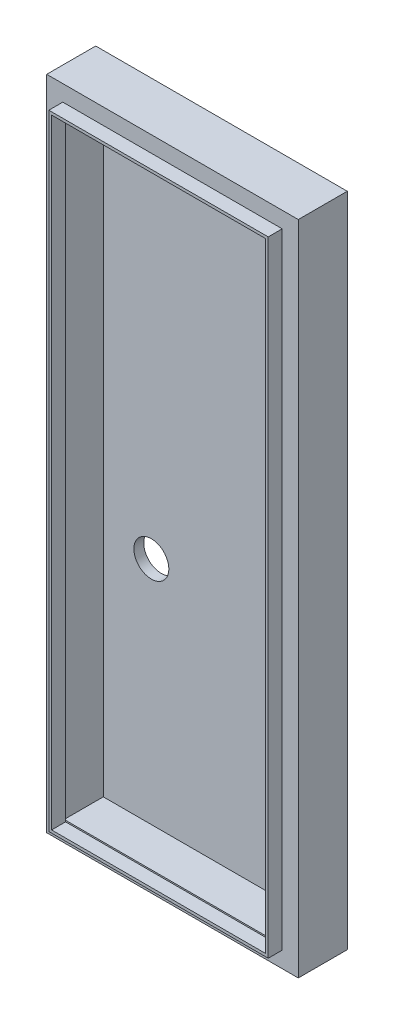
ISO-10303-21;
HEADER;
FILE_DESCRIPTION(('STEP AP214'),'2;1');
FILE_NAME('part.step','',(''),(''),'','','');
FILE_SCHEMA(('AUTOMOTIVE_DESIGN { 1 0 10303 214 1 1 1 1 }'));
ENDSEC;
DATA;
#1=APPLICATION_CONTEXT('core data for automotive mechanical design processes');
#2=APPLICATION_PROTOCOL_DEFINITION('international standard','automotive_design',2000,#1);
#3=PRODUCT_CONTEXT('',#1,'mechanical');
#4=PRODUCT('Part','Part','',(#3));
#5=PRODUCT_RELATED_PRODUCT_CATEGORY('part','',(#4));
#6=PRODUCT_DEFINITION_FORMATION('','',#4);
#7=PRODUCT_DEFINITION_CONTEXT('part definition',#1,'design');
#8=PRODUCT_DEFINITION('design','',#6,#7);
#9=PRODUCT_DEFINITION_SHAPE('','',#8);
#10=(LENGTH_UNIT() NAMED_UNIT(*) SI_UNIT(.MILLI.,.METRE.));
#11=(NAMED_UNIT(*) PLANE_ANGLE_UNIT() SI_UNIT($,.RADIAN.));
#12=(NAMED_UNIT(*) SI_UNIT($,.STERADIAN.) SOLID_ANGLE_UNIT());
#13=UNCERTAINTY_MEASURE_WITH_UNIT(LENGTH_MEASURE(1.E-05),#10,'distance_accuracy_value','');
#14=(GEOMETRIC_REPRESENTATION_CONTEXT(3) GLOBAL_UNCERTAINTY_ASSIGNED_CONTEXT((#13)) GLOBAL_UNIT_ASSIGNED_CONTEXT((#10,
#11,#12)) REPRESENTATION_CONTEXT('',''));
#15=CARTESIAN_POINT('',(0.,0.,0.));
#16=DIRECTION('',(0.,0.,1.));
#17=DIRECTION('',(1.,0.,0.));
#18=AXIS2_PLACEMENT_3D('',#15,#16,#17);
#19=CARTESIAN_POINT('',(-75.5001761711695,1.79262689655173,3.81));
#20=DIRECTION('',(0.,0.,-1.));
#21=DIRECTION('',(-1.,0.,0.));
#22=AXIS2_PLACEMENT_3D('',#19,#20,#21);
#23=CYLINDRICAL_SURFACE('',#22,3.175);
#24=CARTESIAN_POINT('',(-75.5001761711695,1.79262689655173,-7.63682268855597));
#25=DIRECTION('',(0.,0.,-1.));
#26=DIRECTION('',(-1.,0.,0.));
#27=AXIS2_PLACEMENT_3D('',#24,#25,#26);
#28=CIRCLE('',#27,3.175);
#29=CARTESIAN_POINT('',(-78.6751761711695,1.79262689655173,-7.63682268855597));
#30=VERTEX_POINT('',#29);
#31=EDGE_CURVE('E197',#30,#30,#28,.T.);
#32=ORIENTED_EDGE('',*,*,#31,.T.);
#33=EDGE_LOOP('',(#32));
#34=FACE_BOUND('',#33,.T.);
#35=CARTESIAN_POINT('',(-75.5001761711695,1.79262689655173,-5.842));
#36=DIRECTION('',(0.,0.,1.));
#37=DIRECTION('',(1.,0.,0.));
#38=AXIS2_PLACEMENT_3D('',#35,#36,#37);
#39=CIRCLE('',#38,3.175);
#40=CARTESIAN_POINT('',(-72.3251761711695,1.79262689655173,-5.842));
#41=VERTEX_POINT('',#40);
#42=EDGE_CURVE('E37',#41,#41,#39,.F.);
#43=ORIENTED_EDGE('',*,*,#42,.F.);
#44=EDGE_LOOP('',(#43));
#45=FACE_BOUND('',#44,.T.);
#46=ADVANCED_FACE('F33',(#34,#45),#23,.F.);
#47=CARTESIAN_POINT('',(0.,0.,1.27));
#48=DIRECTION('',(0.,0.,-1.));
#49=DIRECTION('',(-1.,0.,0.));
#50=AXIS2_PLACEMENT_3D('',#47,#48,#49);
#51=PLANE('',#50);
#52=DIRECTION('',(1.,0.,0.));
#53=VECTOR('',#52,1.);
#54=CARTESIAN_POINT('',(-87.4051561711695,75.6736068965517,1.27));
#55=LINE('',#54,#53);
#56=CARTESIAN_POINT('',(-87.4051561711695,75.6736068965517,1.27));
#57=VERTEX_POINT('',#56);
#58=CARTESIAN_POINT('',(-41.6851561711695,75.6736068965517,1.27));
#59=VERTEX_POINT('',#58);
#60=EDGE_CURVE('E261',#57,#59,#55,.T.);
#61=ORIENTED_EDGE('',*,*,#60,.F.);
#62=DIRECTION('',(0.,-1.,0.));
#63=VECTOR('',#62,1.);
#64=CARTESIAN_POINT('',(-87.4051561711695,75.6736068965517,1.27));
#65=LINE('',#64,#63);
#66=CARTESIAN_POINT('',(-87.4051561711695,-43.7063931034483,1.27));
#67=VERTEX_POINT('',#66);
#68=EDGE_CURVE('E270',#57,#67,#65,.T.);
#69=ORIENTED_EDGE('',*,*,#68,.T.);
#70=DIRECTION('',(1.,0.,0.));
#71=VECTOR('',#70,1.);
#72=CARTESIAN_POINT('',(-87.4051561711695,-43.7063931034483,1.27));
#73=LINE('',#72,#71);
#74=CARTESIAN_POINT('',(-41.6851561711695,-43.7063931034483,1.27));
#75=VERTEX_POINT('',#74);
#76=EDGE_CURVE('E267',#67,#75,#73,.T.);
#77=ORIENTED_EDGE('',*,*,#76,.T.);
#78=DIRECTION('',(0.,-1.,0.));
#79=VECTOR('',#78,1.);
#80=CARTESIAN_POINT('',(-41.6851561711695,75.6736068965517,1.27));
#81=LINE('',#80,#79);
#82=EDGE_CURVE('E264',#59,#75,#81,.T.);
#83=ORIENTED_EDGE('',*,*,#82,.F.);
#84=EDGE_LOOP('',(#61,#69,#77,#83));
#85=FACE_BOUND('',#84,.T.);
#86=DIRECTION('',(0.,-1.,0.));
#87=VECTOR('',#86,1.);
#88=CARTESIAN_POINT('',(-84.4841561711695,72.7526068965517,1.27));
#89=LINE('',#88,#87);
#90=CARTESIAN_POINT('',(-84.4841561711695,72.7526068965517,1.27));
#91=VERTEX_POINT('',#90);
#92=CARTESIAN_POINT('',(-84.4841561711695,-40.7853931034483,1.27));
#93=VERTEX_POINT('',#92);
#94=EDGE_CURVE('E231',#91,#93,#89,.T.);
#95=ORIENTED_EDGE('',*,*,#94,.F.);
#96=DIRECTION('',(-1.,0.,0.));
#97=VECTOR('',#96,1.);
#98=CARTESIAN_POINT('',(-84.4841561711695,72.7526068965517,1.27));
#99=LINE('',#98,#97);
#100=CARTESIAN_POINT('',(-44.6061561711695,72.7526068965517,1.27));
#101=VERTEX_POINT('',#100);
#102=EDGE_CURVE('E236',#101,#91,#99,.T.);
#103=ORIENTED_EDGE('',*,*,#102,.F.);
#104=DIRECTION('',(0.,1.,0.));
#105=VECTOR('',#104,1.);
#106=CARTESIAN_POINT('',(-44.6061561711695,72.7526068965517,1.27));
#107=LINE('',#106,#105);
#108=CARTESIAN_POINT('',(-44.6061561711695,-40.7853931034483,1.27));
#109=VERTEX_POINT('',#108);
#110=EDGE_CURVE('E246',#109,#101,#107,.T.);
#111=ORIENTED_EDGE('',*,*,#110,.F.);
#112=DIRECTION('',(1.,0.,0.));
#113=VECTOR('',#112,1.);
#114=CARTESIAN_POINT('',(-84.4841561711695,-40.7853931034483,1.27));
#115=LINE('',#114,#113);
#116=EDGE_CURVE('E57',#93,#109,#115,.T.);
#117=ORIENTED_EDGE('',*,*,#116,.F.);
#118=EDGE_LOOP('',(#95,#103,#111,#117));
#119=FACE_BOUND('',#118,.T.);
#120=ADVANCED_FACE('F297',(#85,#119),#51,.F.);
#121=CARTESIAN_POINT('',(-87.4051561711695,75.6736068965517,-7.63682268855597));
#122=DIRECTION('',(0.,-1.,0.));
#123=DIRECTION('',(0.,0.,-1.));
#124=AXIS2_PLACEMENT_3D('',#121,#122,#123);
#125=PLANE('',#124);
#126=DIRECTION('',(0.,0.,1.));
#127=VECTOR('',#126,1.);
#128=CARTESIAN_POINT('',(-87.4051561711695,75.6736068965517,-7.63682268855597));
#129=LINE('',#128,#127);
#130=CARTESIAN_POINT('',(-87.4051561711695,75.6736068965517,-7.63682268855597));
#131=VERTEX_POINT('',#130);
#132=EDGE_CURVE('E284',#131,#57,#129,.T.);
#133=ORIENTED_EDGE('',*,*,#132,.T.);
#134=ORIENTED_EDGE('',*,*,#60,.T.);
#135=DIRECTION('',(0.,0.,1.));
#136=VECTOR('',#135,1.);
#137=CARTESIAN_POINT('',(-41.6851561711695,75.6736068965517,-7.63682268855597));
#138=LINE('',#137,#136);
#139=CARTESIAN_POINT('',(-41.6851561711695,75.6736068965517,-7.63682268855597));
#140=VERTEX_POINT('',#139);
#141=EDGE_CURVE('E11',#140,#59,#138,.T.);
#142=ORIENTED_EDGE('',*,*,#141,.F.);
#143=DIRECTION('',(1.,0.,0.));
#144=VECTOR('',#143,1.);
#145=CARTESIAN_POINT('',(-87.4051561711695,75.6736068965517,-7.63682268855597));
#146=LINE('',#145,#144);
#147=EDGE_CURVE('E273',#131,#140,#146,.T.);
#148=ORIENTED_EDGE('',*,*,#147,.F.);
#149=EDGE_LOOP('',(#133,#134,#142,#148));
#150=FACE_BOUND('',#149,.T.);
#151=ADVANCED_FACE('F35',(#150),#125,.F.);
#152=CARTESIAN_POINT('',(-41.6851561711695,75.6736068965517,-7.63682268855597));
#153=DIRECTION('',(-1.,0.,0.));
#154=DIRECTION('',(0.,-1.,0.));
#155=AXIS2_PLACEMENT_3D('',#152,#153,#154);
#156=PLANE('',#155);
#157=ORIENTED_EDGE('',*,*,#141,.T.);
#158=ORIENTED_EDGE('',*,*,#82,.T.);
#159=DIRECTION('',(0.,0.,1.));
#160=VECTOR('',#159,1.);
#161=CARTESIAN_POINT('',(-41.6851561711695,-43.7063931034483,-7.63682268855597));
#162=LINE('',#161,#160);
#163=CARTESIAN_POINT('',(-41.6851561711695,-43.7063931034483,-7.63682268855597));
#164=VERTEX_POINT('',#163);
#165=EDGE_CURVE('E42',#164,#75,#162,.T.);
#166=ORIENTED_EDGE('',*,*,#165,.F.);
#167=DIRECTION('',(0.,-1.,0.));
#168=VECTOR('',#167,1.);
#169=CARTESIAN_POINT('',(-41.6851561711695,75.6736068965517,-7.63682268855597));
#170=LINE('',#169,#168);
#171=EDGE_CURVE('E276',#140,#164,#170,.T.);
#172=ORIENTED_EDGE('',*,*,#171,.F.);
#173=EDGE_LOOP('',(#157,#158,#166,#172));
#174=FACE_BOUND('',#173,.T.);
#175=ADVANCED_FACE('F299',(#174),#156,.F.);
#176=CARTESIAN_POINT('',(-87.4051561711695,-43.7063931034483,-7.63682268855597));
#177=DIRECTION('',(0.,-1.,0.));
#178=DIRECTION('',(0.,0.,-1.));
#179=AXIS2_PLACEMENT_3D('',#176,#177,#178);
#180=PLANE('',#179);
#181=ORIENTED_EDGE('',*,*,#165,.T.);
#182=ORIENTED_EDGE('',*,*,#76,.F.);
#183=DIRECTION('',(0.,0.,1.));
#184=VECTOR('',#183,1.);
#185=CARTESIAN_POINT('',(-87.4051561711695,-43.7063931034483,-7.63682268855597));
#186=LINE('',#185,#184);
#187=CARTESIAN_POINT('',(-87.4051561711695,-43.7063931034483,-7.63682268855597));
#188=VERTEX_POINT('',#187);
#189=EDGE_CURVE('E286',#188,#67,#186,.T.);
#190=ORIENTED_EDGE('',*,*,#189,.F.);
#191=DIRECTION('',(1.,0.,0.));
#192=VECTOR('',#191,1.);
#193=CARTESIAN_POINT('',(-87.4051561711695,-43.7063931034483,-7.63682268855597));
#194=LINE('',#193,#192);
#195=EDGE_CURVE('E278',#188,#164,#194,.T.);
#196=ORIENTED_EDGE('',*,*,#195,.T.);
#197=EDGE_LOOP('',(#181,#182,#190,#196));
#198=FACE_BOUND('',#197,.T.);
#199=ADVANCED_FACE('F291',(#198),#180,.T.);
#200=CARTESIAN_POINT('',(-87.4051561711695,75.6736068965517,-7.63682268855597));
#201=DIRECTION('',(-1.,0.,0.));
#202=DIRECTION('',(0.,-1.,0.));
#203=AXIS2_PLACEMENT_3D('',#200,#201,#202);
#204=PLANE('',#203);
#205=ORIENTED_EDGE('',*,*,#189,.T.);
#206=ORIENTED_EDGE('',*,*,#68,.F.);
#207=ORIENTED_EDGE('',*,*,#132,.F.);
#208=DIRECTION('',(0.,-1.,0.));
#209=VECTOR('',#208,1.);
#210=CARTESIAN_POINT('',(-87.4051561711695,75.6736068965517,-7.63682268855597));
#211=LINE('',#210,#209);
#212=EDGE_CURVE('E281',#131,#188,#211,.T.);
#213=ORIENTED_EDGE('',*,*,#212,.T.);
#214=EDGE_LOOP('',(#205,#206,#207,#213));
#215=FACE_BOUND('',#214,.T.);
#216=ADVANCED_FACE('F305',(#215),#204,.T.);
#217=CARTESIAN_POINT('',(0.,0.,-7.63682268855597));
#218=DIRECTION('',(0.,0.,-1.));
#219=DIRECTION('',(-1.,0.,0.));
#220=AXIS2_PLACEMENT_3D('',#217,#218,#219);
#221=PLANE('',#220);
#222=ORIENTED_EDGE('',*,*,#31,.F.);
#223=EDGE_LOOP('',(#222));
#224=FACE_BOUND('',#223,.T.);
#225=ORIENTED_EDGE('',*,*,#147,.T.);
#226=ORIENTED_EDGE('',*,*,#171,.T.);
#227=ORIENTED_EDGE('',*,*,#195,.F.);
#228=ORIENTED_EDGE('',*,*,#212,.F.);
#229=EDGE_LOOP('',(#225,#226,#227,#228));
#230=FACE_BOUND('',#229,.T.);
#231=ADVANCED_FACE('F307',(#224,#230),#221,.T.);
#232=CARTESIAN_POINT('',(0.,0.,3.81));
#233=DIRECTION('',(0.,0.,1.));
#234=DIRECTION('',(1.,0.,0.));
#235=AXIS2_PLACEMENT_3D('',#232,#233,#234);
#236=PLANE('',#235);
#237=DIRECTION('',(0.,-1.,0.));
#238=VECTOR('',#237,1.);
#239=CARTESIAN_POINT('',(-84.4841561711695,72.7526068965517,3.81));
#240=LINE('',#239,#238);
#241=CARTESIAN_POINT('',(-84.4841561711695,72.7526068965517,3.81));
#242=VERTEX_POINT('',#241);
#243=CARTESIAN_POINT('',(-84.4841561711695,-40.7853931034483,3.81));
#244=VERTEX_POINT('',#243);
#245=EDGE_CURVE('E232',#242,#244,#240,.T.);
#246=ORIENTED_EDGE('',*,*,#245,.T.);
#247=DIRECTION('',(1.,0.,0.));
#248=VECTOR('',#247,1.);
#249=CARTESIAN_POINT('',(-84.4841561711695,-40.7853931034483,3.81));
#250=LINE('',#249,#248);
#251=CARTESIAN_POINT('',(-44.6061561711695,-40.7853931034483,3.81));
#252=VERTEX_POINT('',#251);
#253=EDGE_CURVE('E235',#244,#252,#250,.T.);
#254=ORIENTED_EDGE('',*,*,#253,.T.);
#255=DIRECTION('',(0.,1.,0.));
#256=VECTOR('',#255,1.);
#257=CARTESIAN_POINT('',(-44.6061561711695,72.7526068965517,3.81));
#258=LINE('',#257,#256);
#259=CARTESIAN_POINT('',(-44.6061561711695,72.7526068965517,3.81));
#260=VERTEX_POINT('',#259);
#261=EDGE_CURVE('E238',#252,#260,#258,.T.);
#262=ORIENTED_EDGE('',*,*,#261,.T.);
#263=DIRECTION('',(-1.,0.,0.));
#264=VECTOR('',#263,1.);
#265=CARTESIAN_POINT('',(-84.4841561711695,72.7526068965517,3.81));
#266=LINE('',#265,#264);
#267=EDGE_CURVE('E240',#260,#242,#266,.T.);
#268=ORIENTED_EDGE('',*,*,#267,.T.);
#269=EDGE_LOOP('',(#246,#254,#262,#268));
#270=FACE_BOUND('',#269,.T.);
#271=DIRECTION('',(1.,0.,0.));
#272=VECTOR('',#271,1.);
#273=CARTESIAN_POINT('',(-83.9761561711695,-40.2773931034483,3.81));
#274=LINE('',#273,#272);
#275=CARTESIAN_POINT('',(-83.9761561711695,-40.2773931034483,3.81));
#276=VERTEX_POINT('',#275);
#277=CARTESIAN_POINT('',(-45.1141561711695,-40.2773931034483,3.81));
#278=VERTEX_POINT('',#277);
#279=EDGE_CURVE('E203',#276,#278,#274,.T.);
#280=ORIENTED_EDGE('',*,*,#279,.F.);
#281=DIRECTION('',(0.,-1.,0.));
#282=VECTOR('',#281,1.);
#283=CARTESIAN_POINT('',(-83.9761561711695,72.2446068965517,3.81));
#284=LINE('',#283,#282);
#285=CARTESIAN_POINT('',(-83.9761561711695,72.2446068965517,3.81));
#286=VERTEX_POINT('',#285);
#287=EDGE_CURVE('E201',#286,#276,#284,.T.);
#288=ORIENTED_EDGE('',*,*,#287,.F.);
#289=DIRECTION('',(-1.,0.,0.));
#290=VECTOR('',#289,1.);
#291=CARTESIAN_POINT('',(-83.9761561711695,72.2446068965517,3.81));
#292=LINE('',#291,#290);
#293=CARTESIAN_POINT('',(-45.1141561711695,72.2446068965517,3.81));
#294=VERTEX_POINT('',#293);
#295=EDGE_CURVE('E209',#294,#286,#292,.T.);
#296=ORIENTED_EDGE('',*,*,#295,.F.);
#297=DIRECTION('',(0.,1.,0.));
#298=VECTOR('',#297,1.);
#299=CARTESIAN_POINT('',(-45.1141561711695,72.2446068965517,3.81));
#300=LINE('',#299,#298);
#301=EDGE_CURVE('E206',#278,#294,#300,.T.);
#302=ORIENTED_EDGE('',*,*,#301,.F.);
#303=EDGE_LOOP('',(#280,#288,#296,#302));
#304=FACE_BOUND('',#303,.T.);
#305=ADVANCED_FACE('F309',(#270,#304),#236,.T.);
#306=CARTESIAN_POINT('',(-84.4841561711695,72.7526068965517,3.81));
#307=DIRECTION('',(1.,0.,0.));
#308=DIRECTION('',(0.,1.,0.));
#309=AXIS2_PLACEMENT_3D('',#306,#307,#308);
#310=PLANE('',#309);
#311=ORIENTED_EDGE('',*,*,#94,.T.);
#312=DIRECTION('',(0.,0.,-1.));
#313=VECTOR('',#312,1.);
#314=CARTESIAN_POINT('',(-84.4841561711695,-40.7853931034483,3.81));
#315=LINE('',#314,#313);
#316=EDGE_CURVE('E259',#244,#93,#315,.T.);
#317=ORIENTED_EDGE('',*,*,#316,.F.);
#318=ORIENTED_EDGE('',*,*,#245,.F.);
#319=DIRECTION('',(0.,0.,-1.));
#320=VECTOR('',#319,1.);
#321=CARTESIAN_POINT('',(-84.4841561711695,72.7526068965517,3.81));
#322=LINE('',#321,#320);
#323=EDGE_CURVE('E242',#242,#91,#322,.T.);
#324=ORIENTED_EDGE('',*,*,#323,.T.);
#325=EDGE_LOOP('',(#311,#317,#318,#324));
#326=FACE_BOUND('',#325,.T.);
#327=ADVANCED_FACE('F316',(#326),#310,.F.);
#328=CARTESIAN_POINT('',(-84.4841561711695,-40.7853931034483,3.81));
#329=DIRECTION('',(0.,1.,0.));
#330=DIRECTION('',(-1.,0.,0.));
#331=AXIS2_PLACEMENT_3D('',#328,#329,#330);
#332=PLANE('',#331);
#333=ORIENTED_EDGE('',*,*,#116,.T.);
#334=DIRECTION('',(0.,0.,-1.));
#335=VECTOR('',#334,1.);
#336=CARTESIAN_POINT('',(-44.6061561711695,-40.7853931034483,3.81));
#337=LINE('',#336,#335);
#338=EDGE_CURVE('E256',#252,#109,#337,.T.);
#339=ORIENTED_EDGE('',*,*,#338,.F.);
#340=ORIENTED_EDGE('',*,*,#253,.F.);
#341=ORIENTED_EDGE('',*,*,#316,.T.);
#342=EDGE_LOOP('',(#333,#339,#340,#341));
#343=FACE_BOUND('',#342,.T.);
#344=ADVANCED_FACE('F356',(#343),#332,.F.);
#345=CARTESIAN_POINT('',(-44.6061561711695,72.7526068965517,3.81));
#346=DIRECTION('',(-1.,0.,0.));
#347=DIRECTION('',(0.,-1.,0.));
#348=AXIS2_PLACEMENT_3D('',#345,#346,#347);
#349=PLANE('',#348);
#350=ORIENTED_EDGE('',*,*,#110,.T.);
#351=DIRECTION('',(0.,0.,-1.));
#352=VECTOR('',#351,1.);
#353=CARTESIAN_POINT('',(-44.6061561711695,72.7526068965517,3.81));
#354=LINE('',#353,#352);
#355=EDGE_CURVE('E253',#260,#101,#354,.T.);
#356=ORIENTED_EDGE('',*,*,#355,.F.);
#357=ORIENTED_EDGE('',*,*,#261,.F.);
#358=ORIENTED_EDGE('',*,*,#338,.T.);
#359=EDGE_LOOP('',(#350,#356,#357,#358));
#360=FACE_BOUND('',#359,.T.);
#361=ADVANCED_FACE('F352',(#360),#349,.F.);
#362=CARTESIAN_POINT('',(-84.4841561711695,72.7526068965517,3.81));
#363=DIRECTION('',(0.,-1.,0.));
#364=DIRECTION('',(0.,0.,-1.));
#365=AXIS2_PLACEMENT_3D('',#362,#363,#364);
#366=PLANE('',#365);
#367=ORIENTED_EDGE('',*,*,#102,.T.);
#368=ORIENTED_EDGE('',*,*,#323,.F.);
#369=ORIENTED_EDGE('',*,*,#267,.F.);
#370=ORIENTED_EDGE('',*,*,#355,.T.);
#371=EDGE_LOOP('',(#367,#368,#369,#370));
#372=FACE_BOUND('',#371,.T.);
#373=ADVANCED_FACE('F347',(#372),#366,.F.);
#374=CARTESIAN_POINT('',(-83.9761561711695,72.2446068965517,3.81));
#375=DIRECTION('',(1.,0.,0.));
#376=DIRECTION('',(0.,1.,0.));
#377=AXIS2_PLACEMENT_3D('',#374,#375,#376);
#378=PLANE('',#377);
#379=DIRECTION('',(0.,-1.,0.));
#380=VECTOR('',#379,1.);
#381=CARTESIAN_POINT('',(-83.9761561711695,72.2446068965517,1.27));
#382=LINE('',#381,#380);
#383=CARTESIAN_POINT('',(-83.9761561711695,72.2446068965517,1.27));
#384=VERTEX_POINT('',#383);
#385=CARTESIAN_POINT('',(-83.9761561711695,-40.0233931034483,1.27));
#386=VERTEX_POINT('',#385);
#387=EDGE_CURVE('E212',#384,#386,#382,.T.);
#388=ORIENTED_EDGE('',*,*,#387,.F.);
#389=DIRECTION('',(0.,0.,-1.));
#390=VECTOR('',#389,1.);
#391=CARTESIAN_POINT('',(-83.9761561711695,72.2446068965517,3.81));
#392=LINE('',#391,#390);
#393=EDGE_CURVE('E211',#286,#384,#392,.T.);
#394=ORIENTED_EDGE('',*,*,#393,.F.);
#395=ORIENTED_EDGE('',*,*,#287,.T.);
#396=DIRECTION('',(0.,0.,-1.));
#397=VECTOR('',#396,1.);
#398=CARTESIAN_POINT('',(-83.9761561711695,-40.2773931034483,3.81));
#399=LINE('',#398,#397);
#400=CARTESIAN_POINT('',(-83.9761561711695,-40.2773931034483,1.27));
#401=VERTEX_POINT('',#400);
#402=EDGE_CURVE('E228',#276,#401,#399,.T.);
#403=ORIENTED_EDGE('',*,*,#402,.T.);
#404=EDGE_CURVE('E200',#386,#401,#382,.T.);
#405=ORIENTED_EDGE('',*,*,#404,.F.);
#406=EDGE_LOOP('',(#388,#394,#395,#403,#405));
#407=FACE_BOUND('',#406,.T.);
#408=ADVANCED_FACE('F344',(#407),#378,.T.);
#409=CARTESIAN_POINT('',(-83.9761561711695,-40.2773931034483,3.81));
#410=DIRECTION('',(0.,1.,0.));
#411=DIRECTION('',(0.,0.,1.));
#412=AXIS2_PLACEMENT_3D('',#409,#410,#411);
#413=PLANE('',#412);
#414=DIRECTION('',(1.,0.,0.));
#415=VECTOR('',#414,1.);
#416=CARTESIAN_POINT('',(-83.9761561711695,-40.2773931034483,1.27));
#417=LINE('',#416,#415);
#418=CARTESIAN_POINT('',(-45.1141561711695,-40.2773931034483,1.27));
#419=VERTEX_POINT('',#418);
#420=EDGE_CURVE('E214',#401,#419,#417,.T.);
#421=ORIENTED_EDGE('',*,*,#420,.F.);
#422=ORIENTED_EDGE('',*,*,#402,.F.);
#423=ORIENTED_EDGE('',*,*,#279,.T.);
#424=DIRECTION('',(0.,0.,-1.));
#425=VECTOR('',#424,1.);
#426=CARTESIAN_POINT('',(-45.1141561711695,-40.2773931034483,3.81));
#427=LINE('',#426,#425);
#428=EDGE_CURVE('E226',#278,#419,#427,.T.);
#429=ORIENTED_EDGE('',*,*,#428,.T.);
#430=EDGE_LOOP('',(#421,#422,#423,#429));
#431=FACE_BOUND('',#430,.T.);
#432=ADVANCED_FACE('F340',(#431),#413,.T.);
#433=CARTESIAN_POINT('',(-45.1141561711695,72.2446068965517,3.81));
#434=DIRECTION('',(-1.,0.,0.));
#435=DIRECTION('',(0.,-1.,0.));
#436=AXIS2_PLACEMENT_3D('',#433,#434,#435);
#437=PLANE('',#436);
#438=DIRECTION('',(0.,1.,0.));
#439=VECTOR('',#438,1.);
#440=CARTESIAN_POINT('',(-45.1141561711695,72.2446068965517,1.27));
#441=LINE('',#440,#439);
#442=CARTESIAN_POINT('',(-45.1141561711695,-40.0233931034483,1.27));
#443=VERTEX_POINT('',#442);
#444=EDGE_CURVE('E217',#419,#443,#441,.T.);
#445=ORIENTED_EDGE('',*,*,#444,.F.);
#446=ORIENTED_EDGE('',*,*,#428,.F.);
#447=ORIENTED_EDGE('',*,*,#301,.T.);
#448=DIRECTION('',(0.,0.,-1.));
#449=VECTOR('',#448,1.);
#450=CARTESIAN_POINT('',(-45.1141561711695,72.2446068965517,3.81));
#451=LINE('',#450,#449);
#452=CARTESIAN_POINT('',(-45.1141561711695,72.2446068965517,1.27));
#453=VERTEX_POINT('',#452);
#454=EDGE_CURVE('E223',#294,#453,#451,.T.);
#455=ORIENTED_EDGE('',*,*,#454,.T.);
#456=DIRECTION('',(0.,1.,0.));
#457=VECTOR('',#456,1.);
#458=CARTESIAN_POINT('',(-45.1141561711695,72.2446068965517,1.27));
#459=LINE('',#458,#457);
#460=EDGE_CURVE('E192',#443,#453,#459,.T.);
#461=ORIENTED_EDGE('',*,*,#460,.F.);
#462=EDGE_LOOP('',(#445,#446,#447,#455,#461));
#463=FACE_BOUND('',#462,.T.);
#464=ADVANCED_FACE('F336',(#463),#437,.T.);
#465=CARTESIAN_POINT('',(-83.9761561711695,72.2446068965517,3.81));
#466=DIRECTION('',(0.,-1.,0.));
#467=DIRECTION('',(0.,0.,-1.));
#468=AXIS2_PLACEMENT_3D('',#465,#466,#467);
#469=PLANE('',#468);
#470=DIRECTION('',(-1.,0.,0.));
#471=VECTOR('',#470,1.);
#472=CARTESIAN_POINT('',(-83.9761561711695,72.2446068965517,1.27));
#473=LINE('',#472,#471);
#474=EDGE_CURVE('E204',#453,#384,#473,.T.);
#475=ORIENTED_EDGE('',*,*,#474,.F.);
#476=ORIENTED_EDGE('',*,*,#454,.F.);
#477=ORIENTED_EDGE('',*,*,#295,.T.);
#478=ORIENTED_EDGE('',*,*,#393,.T.);
#479=EDGE_LOOP('',(#475,#476,#477,#478));
#480=FACE_BOUND('',#479,.T.);
#481=ADVANCED_FACE('F333',(#480),#469,.T.);
#482=ORIENTED_EDGE('',*,*,#444,.T.);
#483=DIRECTION('',(1.,0.,0.));
#484=VECTOR('',#483,1.);
#485=CARTESIAN_POINT('',(-84.2301561711695,-40.0233931034483,1.27));
#486=LINE('',#485,#484);
#487=EDGE_CURVE('E187',#386,#443,#486,.T.);
#488=ORIENTED_EDGE('',*,*,#487,.F.);
#489=ORIENTED_EDGE('',*,*,#404,.T.);
#490=ORIENTED_EDGE('',*,*,#420,.T.);
#491=EDGE_LOOP('',(#482,#488,#489,#490));
#492=FACE_BOUND('',#491,.T.);
#493=ADVANCED_FACE('F328',(#492),#51,.F.);
#494=CARTESIAN_POINT('',(0.,0.,-5.842));
#495=DIRECTION('',(0.,0.,1.));
#496=DIRECTION('',(1.,0.,0.));
#497=AXIS2_PLACEMENT_3D('',#494,#495,#496);
#498=PLANE('',#497);
#499=DIRECTION('',(0.,-1.,0.));
#500=VECTOR('',#499,1.);
#501=CARTESIAN_POINT('',(-84.2301561711695,72.4986068965517,-5.842));
#502=LINE('',#501,#500);
#503=CARTESIAN_POINT('',(-84.2301561711695,72.4986068965517,-5.842));
#504=VERTEX_POINT('',#503);
#505=CARTESIAN_POINT('',(-84.2301561711695,-40.0233931034483,-5.842));
#506=VERTEX_POINT('',#505);
#507=EDGE_CURVE('E157',#504,#506,#502,.T.);
#508=ORIENTED_EDGE('',*,*,#507,.T.);
#509=DIRECTION('',(1.,0.,0.));
#510=VECTOR('',#509,1.);
#511=CARTESIAN_POINT('',(-84.2301561711695,-40.0233931034483,-5.842));
#512=LINE('',#511,#510);
#513=CARTESIAN_POINT('',(-44.8601561711695,-40.0233931034483,-5.842));
#514=VERTEX_POINT('',#513);
#515=EDGE_CURVE('E165',#506,#514,#512,.T.);
#516=ORIENTED_EDGE('',*,*,#515,.T.);
#517=DIRECTION('',(0.,1.,0.));
#518=VECTOR('',#517,1.);
#519=CARTESIAN_POINT('',(-44.8601561711695,72.4986068965517,-5.842));
#520=LINE('',#519,#518);
#521=CARTESIAN_POINT('',(-44.8601561711695,72.4986068965517,-5.842));
#522=VERTEX_POINT('',#521);
#523=EDGE_CURVE('E171',#514,#522,#520,.T.);
#524=ORIENTED_EDGE('',*,*,#523,.T.);
#525=DIRECTION('',(-1.,0.,0.));
#526=VECTOR('',#525,1.);
#527=CARTESIAN_POINT('',(-84.2301561711695,72.4986068965517,-5.842));
#528=LINE('',#527,#526);
#529=EDGE_CURVE('E162',#522,#504,#528,.T.);
#530=ORIENTED_EDGE('',*,*,#529,.T.);
#531=EDGE_LOOP('',(#508,#516,#524,#530));
#532=FACE_BOUND('',#531,.T.);
#533=ORIENTED_EDGE('',*,*,#42,.T.);
#534=EDGE_LOOP('',(#533));
#535=FACE_BOUND('',#534,.T.);
#536=ADVANCED_FACE('F173',(#532,#535),#498,.T.);
#537=CARTESIAN_POINT('',(0.,0.,1.27));
#538=DIRECTION('',(0.,0.,1.));
#539=DIRECTION('',(1.,0.,0.));
#540=AXIS2_PLACEMENT_3D('',#537,#538,#539);
#541=PLANE('',#540);
#542=ORIENTED_EDGE('',*,*,#387,.T.);
#543=CARTESIAN_POINT('',(-84.2301561711695,-40.0233931034483,1.27));
#544=VERTEX_POINT('',#543);
#545=EDGE_CURVE('E49',#544,#386,#486,.T.);
#546=ORIENTED_EDGE('',*,*,#545,.F.);
#547=DIRECTION('',(0.,-1.,0.));
#548=VECTOR('',#547,1.);
#549=CARTESIAN_POINT('',(-84.2301561711695,72.4986068965517,1.27));
#550=LINE('',#549,#548);
#551=CARTESIAN_POINT('',(-84.2301561711695,72.4986068965517,1.27));
#552=VERTEX_POINT('',#551);
#553=EDGE_CURVE('E160',#552,#544,#550,.T.);
#554=ORIENTED_EDGE('',*,*,#553,.F.);
#555=DIRECTION('',(-1.,0.,0.));
#556=VECTOR('',#555,1.);
#557=CARTESIAN_POINT('',(-84.2301561711695,72.4986068965517,1.27));
#558=LINE('',#557,#556);
#559=CARTESIAN_POINT('',(-44.8601561711695,72.4986068965517,1.27));
#560=VERTEX_POINT('',#559);
#561=EDGE_CURVE('E176',#560,#552,#558,.T.);
#562=ORIENTED_EDGE('',*,*,#561,.F.);
#563=DIRECTION('',(0.,1.,0.));
#564=VECTOR('',#563,1.);
#565=CARTESIAN_POINT('',(-44.8601561711695,72.4986068965517,1.27));
#566=LINE('',#565,#564);
#567=CARTESIAN_POINT('',(-44.8601561711695,-40.0233931034483,1.27));
#568=VERTEX_POINT('',#567);
#569=EDGE_CURVE('E179',#568,#560,#566,.T.);
#570=ORIENTED_EDGE('',*,*,#569,.F.);
#571=EDGE_CURVE('E185',#443,#568,#486,.T.);
#572=ORIENTED_EDGE('',*,*,#571,.F.);
#573=ORIENTED_EDGE('',*,*,#460,.T.);
#574=ORIENTED_EDGE('',*,*,#474,.T.);
#575=EDGE_LOOP('',(#542,#546,#554,#562,#570,#572,#573,#574));
#576=FACE_BOUND('',#575,.T.);
#577=ADVANCED_FACE('F368',(#576),#541,.F.);
#578=CARTESIAN_POINT('',(-84.2301561711695,72.4986068965517,-5.842));
#579=DIRECTION('',(-1.,0.,0.));
#580=DIRECTION('',(0.,-1.,0.));
#581=AXIS2_PLACEMENT_3D('',#578,#579,#580);
#582=PLANE('',#581);
#583=ORIENTED_EDGE('',*,*,#553,.T.);
#584=DIRECTION('',(0.,0.,1.));
#585=VECTOR('',#584,1.);
#586=CARTESIAN_POINT('',(-84.2301561711695,-40.0233931034483,-5.842));
#587=LINE('',#586,#585);
#588=EDGE_CURVE('E153',#506,#544,#587,.T.);
#589=ORIENTED_EDGE('',*,*,#588,.F.);
#590=ORIENTED_EDGE('',*,*,#507,.F.);
#591=DIRECTION('',(0.,0.,1.));
#592=VECTOR('',#591,1.);
#593=CARTESIAN_POINT('',(-84.2301561711695,72.4986068965517,-5.842));
#594=LINE('',#593,#592);
#595=EDGE_CURVE('E190',#504,#552,#594,.T.);
#596=ORIENTED_EDGE('',*,*,#595,.T.);
#597=EDGE_LOOP('',(#583,#589,#590,#596));
#598=FACE_BOUND('',#597,.T.);
#599=ADVANCED_FACE('F155',(#598),#582,.F.);
#600=CARTESIAN_POINT('',(-84.2301561711695,72.4986068965517,-5.842));
#601=DIRECTION('',(0.,1.,0.));
#602=DIRECTION('',(0.,0.,1.));
#603=AXIS2_PLACEMENT_3D('',#600,#601,#602);
#604=PLANE('',#603);
#605=ORIENTED_EDGE('',*,*,#561,.T.);
#606=ORIENTED_EDGE('',*,*,#595,.F.);
#607=ORIENTED_EDGE('',*,*,#529,.F.);
#608=DIRECTION('',(0.,0.,1.));
#609=VECTOR('',#608,1.);
#610=CARTESIAN_POINT('',(-44.8601561711695,72.4986068965517,-5.842));
#611=LINE('',#610,#609);
#612=EDGE_CURVE('E193',#522,#560,#611,.T.);
#613=ORIENTED_EDGE('',*,*,#612,.T.);
#614=EDGE_LOOP('',(#605,#606,#607,#613));
#615=FACE_BOUND('',#614,.T.);
#616=ADVANCED_FACE('F384',(#615),#604,.F.);
#617=CARTESIAN_POINT('',(-44.8601561711695,72.4986068965517,-5.842));
#618=DIRECTION('',(1.,0.,0.));
#619=DIRECTION('',(0.,1.,0.));
#620=AXIS2_PLACEMENT_3D('',#617,#618,#619);
#621=PLANE('',#620);
#622=ORIENTED_EDGE('',*,*,#569,.T.);
#623=ORIENTED_EDGE('',*,*,#612,.F.);
#624=ORIENTED_EDGE('',*,*,#523,.F.);
#625=DIRECTION('',(0.,0.,1.));
#626=VECTOR('',#625,1.);
#627=CARTESIAN_POINT('',(-44.8601561711695,-40.0233931034483,-5.842));
#628=LINE('',#627,#626);
#629=EDGE_CURVE('E161',#514,#568,#628,.T.);
#630=ORIENTED_EDGE('',*,*,#629,.T.);
#631=EDGE_LOOP('',(#622,#623,#624,#630));
#632=FACE_BOUND('',#631,.T.);
#633=ADVANCED_FACE('F382',(#632),#621,.F.);
#634=CARTESIAN_POINT('',(-84.2301561711695,-40.0233931034483,-5.842));
#635=DIRECTION('',(0.,-1.,0.));
#636=DIRECTION('',(0.,0.,-1.));
#637=AXIS2_PLACEMENT_3D('',#634,#635,#636);
#638=PLANE('',#637);
#639=ORIENTED_EDGE('',*,*,#545,.T.);
#640=ORIENTED_EDGE('',*,*,#487,.T.);
#641=ORIENTED_EDGE('',*,*,#571,.T.);
#642=ORIENTED_EDGE('',*,*,#629,.F.);
#643=ORIENTED_EDGE('',*,*,#515,.F.);
#644=ORIENTED_EDGE('',*,*,#588,.T.);
#645=EDGE_LOOP('',(#639,#640,#641,#642,#643,#644));
#646=FACE_BOUND('',#645,.T.);
#647=ADVANCED_FACE('F166',(#646),#638,.F.);
#648=CLOSED_SHELL('',(#46,#120,#151,#175,#199,#216,#231,#305,#327,#344,#361,#373,#408,#432,#464,
#481,#493,#536,#577,#599,#616,#633,#647));
#649=MANIFOLD_SOLID_BREP('B2',#648);
#650=ADVANCED_BREP_SHAPE_REPRESENTATION('',(#18,#649),#14);
#651=SHAPE_DEFINITION_REPRESENTATION(#9,#650);
ENDSEC;
END-ISO-10303-21;
